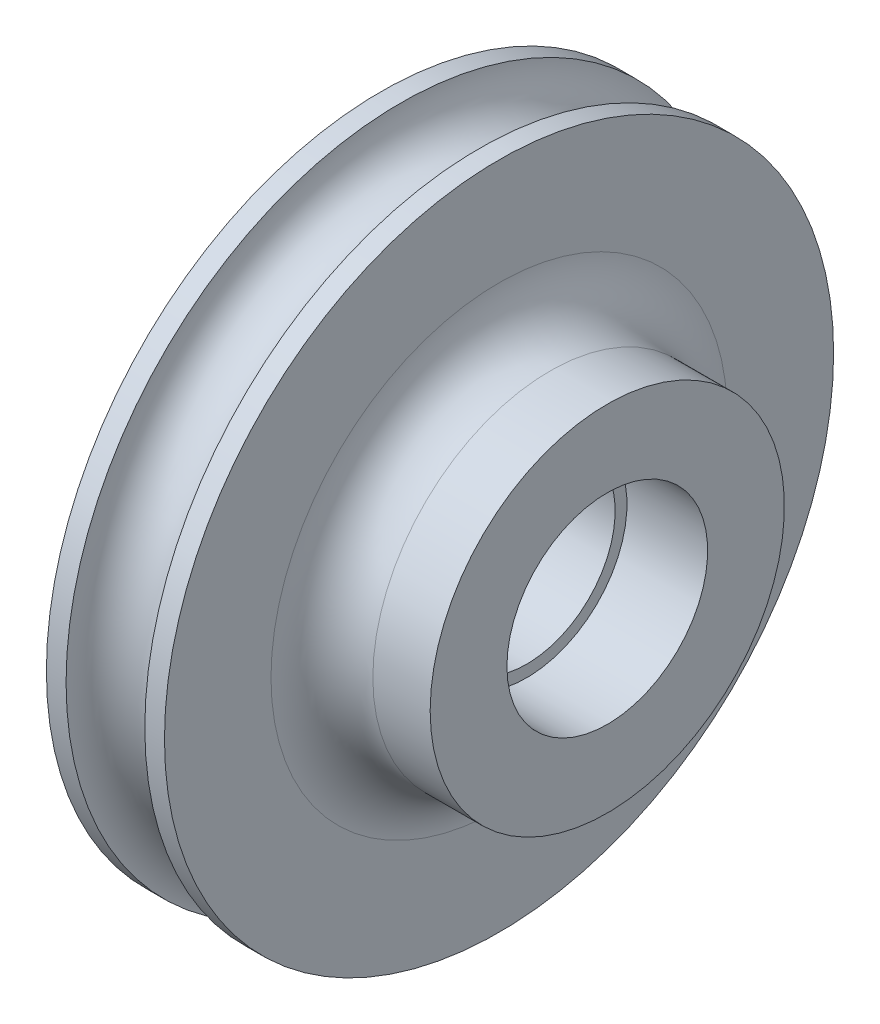
ISO-10303-21;
HEADER;
FILE_DESCRIPTION(('STEP AP214'),'2;1');
FILE_NAME('part.step','',(''),(''),'','','');
FILE_SCHEMA(('AUTOMOTIVE_DESIGN { 1 0 10303 214 1 1 1 1 }'));
ENDSEC;
DATA;
#1=APPLICATION_CONTEXT('core data for automotive mechanical design processes');
#2=APPLICATION_PROTOCOL_DEFINITION('international standard','automotive_design',2000,#1);
#3=PRODUCT_CONTEXT('',#1,'mechanical');
#4=PRODUCT('Part','Part','',(#3));
#5=PRODUCT_RELATED_PRODUCT_CATEGORY('part','',(#4));
#6=PRODUCT_DEFINITION_FORMATION('','',#4);
#7=PRODUCT_DEFINITION_CONTEXT('part definition',#1,'design');
#8=PRODUCT_DEFINITION('design','',#6,#7);
#9=PRODUCT_DEFINITION_SHAPE('','',#8);
#10=(LENGTH_UNIT() NAMED_UNIT(*) SI_UNIT(.MILLI.,.METRE.));
#11=(NAMED_UNIT(*) PLANE_ANGLE_UNIT() SI_UNIT($,.RADIAN.));
#12=(NAMED_UNIT(*) SI_UNIT($,.STERADIAN.) SOLID_ANGLE_UNIT());
#13=UNCERTAINTY_MEASURE_WITH_UNIT(LENGTH_MEASURE(1.E-05),#10,'distance_accuracy_value','');
#14=(GEOMETRIC_REPRESENTATION_CONTEXT(3) GLOBAL_UNCERTAINTY_ASSIGNED_CONTEXT((#13)) GLOBAL_UNIT_ASSIGNED_CONTEXT((#10,
#11,#12)) REPRESENTATION_CONTEXT('',''));
#15=CARTESIAN_POINT('',(0.,0.,0.));
#16=DIRECTION('',(0.,0.,1.));
#17=DIRECTION('',(1.,0.,0.));
#18=AXIS2_PLACEMENT_3D('',#15,#16,#17);
#19=CARTESIAN_POINT('',(0.,0.,0.));
#20=DIRECTION('',(-1.,0.,0.));
#21=DIRECTION('',(0.,0.,1.));
#22=AXIS2_PLACEMENT_3D('',#19,#20,#21);
#23=TOROIDAL_SURFACE('',#22,17.,2.);
#24=CARTESIAN_POINT('',(-2.,0.,0.));
#25=DIRECTION('',(-1.,0.,0.));
#26=DIRECTION('',(0.,0.,1.));
#27=AXIS2_PLACEMENT_3D('',#24,#25,#26);
#28=CIRCLE('',#27,17.);
#29=CARTESIAN_POINT('',(-2.,0.,17.));
#30=VERTEX_POINT('',#29);
#31=EDGE_CURVE('E10',#30,#30,#28,.T.);
#32=ORIENTED_EDGE('',*,*,#31,.F.);
#33=EDGE_LOOP('',(#32));
#34=FACE_BOUND('',#33,.T.);
#35=CARTESIAN_POINT('',(2.,0.,0.));
#36=DIRECTION('',(-1.,0.,0.));
#37=DIRECTION('',(0.,0.,1.));
#38=AXIS2_PLACEMENT_3D('',#35,#36,#37);
#39=CIRCLE('',#38,17.);
#40=CARTESIAN_POINT('',(2.,0.,17.));
#41=VERTEX_POINT('',#40);
#42=EDGE_CURVE('E76',#41,#41,#39,.T.);
#43=ORIENTED_EDGE('',*,*,#42,.T.);
#44=EDGE_LOOP('',(#43));
#45=FACE_BOUND('',#44,.T.);
#46=ADVANCED_FACE('F33',(#34,#45),#23,.F.);
#47=CARTESIAN_POINT('',(0.,0.,0.));
#48=DIRECTION('',(-1.,0.,0.));
#49=DIRECTION('',(0.,0.,1.));
#50=AXIS2_PLACEMENT_3D('',#47,#48,#49);
#51=CYLINDRICAL_SURFACE('',#50,17.);
#52=CARTESIAN_POINT('',(-3.,0.,0.));
#53=DIRECTION('',(-1.,0.,0.));
#54=DIRECTION('',(0.,0.,1.));
#55=AXIS2_PLACEMENT_3D('',#52,#53,#54);
#56=CIRCLE('',#55,17.);
#57=CARTESIAN_POINT('',(-3.,0.,17.));
#58=VERTEX_POINT('',#57);
#59=EDGE_CURVE('E39',#58,#58,#56,.T.);
#60=ORIENTED_EDGE('',*,*,#59,.F.);
#61=EDGE_LOOP('',(#60));
#62=FACE_BOUND('',#61,.T.);
#63=ORIENTED_EDGE('',*,*,#31,.T.);
#64=EDGE_LOOP('',(#63));
#65=FACE_BOUND('',#64,.T.);
#66=ADVANCED_FACE('F143',(#62,#65),#51,.T.);
#67=CARTESIAN_POINT('',(-3.,17.,0.));
#68=DIRECTION('',(1.,0.,0.));
#69=DIRECTION('',(0.,0.,-1.));
#70=AXIS2_PLACEMENT_3D('',#67,#68,#69);
#71=PLANE('',#70);
#72=CARTESIAN_POINT('',(-3.,0.,0.));
#73=DIRECTION('',(-1.,0.,0.));
#74=DIRECTION('',(0.,0.,1.));
#75=AXIS2_PLACEMENT_3D('',#72,#73,#74);
#76=CIRCLE('',#75,5.1);
#77=CARTESIAN_POINT('',(-3.,0.,5.1));
#78=VERTEX_POINT('',#77);
#79=EDGE_CURVE('E43',#78,#78,#76,.T.);
#80=ORIENTED_EDGE('',*,*,#79,.F.);
#81=EDGE_LOOP('',(#80));
#82=FACE_BOUND('',#81,.T.);
#83=ORIENTED_EDGE('',*,*,#59,.T.);
#84=EDGE_LOOP('',(#83));
#85=FACE_BOUND('',#84,.T.);
#86=ADVANCED_FACE('F138',(#82,#85),#71,.F.);
#87=CARTESIAN_POINT('',(0.,0.,0.));
#88=DIRECTION('',(-1.,0.,0.));
#89=DIRECTION('',(0.,0.,1.));
#90=AXIS2_PLACEMENT_3D('',#87,#88,#89);
#91=CYLINDRICAL_SURFACE('',#90,5.1);
#92=CARTESIAN_POINT('',(1.1,0.,0.));
#93=DIRECTION('',(-1.,0.,0.));
#94=DIRECTION('',(0.,0.,1.));
#95=AXIS2_PLACEMENT_3D('',#92,#93,#94);
#96=CIRCLE('',#95,5.1);
#97=CARTESIAN_POINT('',(1.1,0.,5.1));
#98=VERTEX_POINT('',#97);
#99=EDGE_CURVE('E47',#98,#98,#96,.T.);
#100=ORIENTED_EDGE('',*,*,#99,.F.);
#101=EDGE_LOOP('',(#100));
#102=FACE_BOUND('',#101,.T.);
#103=ORIENTED_EDGE('',*,*,#79,.T.);
#104=EDGE_LOOP('',(#103));
#105=FACE_BOUND('',#104,.T.);
#106=ADVANCED_FACE('F132',(#102,#105),#91,.F.);
#107=CARTESIAN_POINT('',(1.1,5.1,0.));
#108=DIRECTION('',(1.,0.,0.));
#109=DIRECTION('',(0.,0.,-1.));
#110=AXIS2_PLACEMENT_3D('',#107,#108,#109);
#111=PLANE('',#110);
#112=CARTESIAN_POINT('',(1.1,0.,0.));
#113=DIRECTION('',(-1.,0.,0.));
#114=DIRECTION('',(0.,0.,1.));
#115=AXIS2_PLACEMENT_3D('',#112,#113,#114);
#116=CIRCLE('',#115,4.5);
#117=CARTESIAN_POINT('',(1.1,0.,4.5));
#118=VERTEX_POINT('',#117);
#119=EDGE_CURVE('E52',#118,#118,#116,.T.);
#120=ORIENTED_EDGE('',*,*,#119,.F.);
#121=EDGE_LOOP('',(#120));
#122=FACE_BOUND('',#121,.T.);
#123=ORIENTED_EDGE('',*,*,#99,.T.);
#124=EDGE_LOOP('',(#123));
#125=FACE_BOUND('',#124,.T.);
#126=ADVANCED_FACE('F126',(#122,#125),#111,.F.);
#127=CARTESIAN_POINT('',(0.,0.,0.));
#128=DIRECTION('',(-1.,0.,0.));
#129=DIRECTION('',(0.,0.,1.));
#130=AXIS2_PLACEMENT_3D('',#127,#128,#129);
#131=CYLINDRICAL_SURFACE('',#130,4.5);
#132=CARTESIAN_POINT('',(4.4,0.,0.));
#133=DIRECTION('',(-1.,0.,0.));
#134=DIRECTION('',(0.,0.,1.));
#135=AXIS2_PLACEMENT_3D('',#132,#133,#134);
#136=CIRCLE('',#135,4.5);
#137=CARTESIAN_POINT('',(4.4,0.,4.5));
#138=VERTEX_POINT('',#137);
#139=EDGE_CURVE('E55',#138,#138,#136,.T.);
#140=ORIENTED_EDGE('',*,*,#139,.F.);
#141=EDGE_LOOP('',(#140));
#142=FACE_BOUND('',#141,.T.);
#143=ORIENTED_EDGE('',*,*,#119,.T.);
#144=EDGE_LOOP('',(#143));
#145=FACE_BOUND('',#144,.T.);
#146=ADVANCED_FACE('F120',(#142,#145),#131,.F.);
#147=CARTESIAN_POINT('',(4.4,5.1,0.));
#148=DIRECTION('',(-1.,0.,0.));
#149=DIRECTION('',(0.,0.,1.));
#150=AXIS2_PLACEMENT_3D('',#147,#148,#149);
#151=PLANE('',#150);
#152=CARTESIAN_POINT('',(4.4,0.,0.));
#153=DIRECTION('',(-1.,0.,0.));
#154=DIRECTION('',(0.,0.,1.));
#155=AXIS2_PLACEMENT_3D('',#152,#153,#154);
#156=CIRCLE('',#155,5.1);
#157=CARTESIAN_POINT('',(4.4,0.,5.1));
#158=VERTEX_POINT('',#157);
#159=EDGE_CURVE('E58',#158,#158,#156,.T.);
#160=ORIENTED_EDGE('',*,*,#159,.F.);
#161=EDGE_LOOP('',(#160));
#162=FACE_BOUND('',#161,.T.);
#163=ORIENTED_EDGE('',*,*,#139,.T.);
#164=EDGE_LOOP('',(#163));
#165=FACE_BOUND('',#164,.T.);
#166=ADVANCED_FACE('F114',(#162,#165),#151,.F.);
#167=CARTESIAN_POINT('',(0.,0.,0.));
#168=DIRECTION('',(-1.,0.,0.));
#169=DIRECTION('',(0.,0.,1.));
#170=AXIS2_PLACEMENT_3D('',#167,#168,#169);
#171=CYLINDRICAL_SURFACE('',#170,5.1);
#172=CARTESIAN_POINT('',(8.5,0.,0.));
#173=DIRECTION('',(-1.,0.,0.));
#174=DIRECTION('',(0.,0.,1.));
#175=AXIS2_PLACEMENT_3D('',#172,#173,#174);
#176=CIRCLE('',#175,5.1);
#177=CARTESIAN_POINT('',(8.5,0.,5.1));
#178=VERTEX_POINT('',#177);
#179=EDGE_CURVE('E61',#178,#178,#176,.T.);
#180=ORIENTED_EDGE('',*,*,#179,.F.);
#181=EDGE_LOOP('',(#180));
#182=FACE_BOUND('',#181,.T.);
#183=ORIENTED_EDGE('',*,*,#159,.T.);
#184=EDGE_LOOP('',(#183));
#185=FACE_BOUND('',#184,.T.);
#186=ADVANCED_FACE('F108',(#182,#185),#171,.F.);
#187=CARTESIAN_POINT('',(8.5,9.,0.));
#188=DIRECTION('',(-1.,0.,0.));
#189=DIRECTION('',(0.,0.,1.));
#190=AXIS2_PLACEMENT_3D('',#187,#188,#189);
#191=PLANE('',#190);
#192=CARTESIAN_POINT('',(8.5,0.,0.));
#193=DIRECTION('',(-1.,0.,0.));
#194=DIRECTION('',(0.,0.,1.));
#195=AXIS2_PLACEMENT_3D('',#192,#193,#194);
#196=CIRCLE('',#195,9.);
#197=CARTESIAN_POINT('',(8.5,0.,9.));
#198=VERTEX_POINT('',#197);
#199=EDGE_CURVE('E64',#198,#198,#196,.T.);
#200=ORIENTED_EDGE('',*,*,#199,.F.);
#201=EDGE_LOOP('',(#200));
#202=FACE_BOUND('',#201,.T.);
#203=ORIENTED_EDGE('',*,*,#179,.T.);
#204=EDGE_LOOP('',(#203));
#205=FACE_BOUND('',#204,.T.);
#206=ADVANCED_FACE('F102',(#202,#205),#191,.F.);
#207=CARTESIAN_POINT('',(0.,0.,0.));
#208=DIRECTION('',(-1.,0.,0.));
#209=DIRECTION('',(0.,0.,1.));
#210=AXIS2_PLACEMENT_3D('',#207,#208,#209);
#211=CYLINDRICAL_SURFACE('',#210,9.);
#212=CARTESIAN_POINT('',(5.58796448278056,0.,0.));
#213=DIRECTION('',(-1.,0.,0.));
#214=DIRECTION('',(0.,0.,1.));
#215=AXIS2_PLACEMENT_3D('',#212,#213,#214);
#216=CIRCLE('',#215,9.);
#217=CARTESIAN_POINT('',(5.58796448278056,0.,9.));
#218=VERTEX_POINT('',#217);
#219=EDGE_CURVE('E67',#218,#218,#216,.T.);
#220=ORIENTED_EDGE('',*,*,#219,.F.);
#221=EDGE_LOOP('',(#220));
#222=FACE_BOUND('',#221,.T.);
#223=ORIENTED_EDGE('',*,*,#199,.T.);
#224=EDGE_LOOP('',(#223));
#225=FACE_BOUND('',#224,.T.);
#226=ADVANCED_FACE('F96',(#222,#225),#211,.T.);
#227=CARTESIAN_POINT('',(5.58796448278056,0.,0.));
#228=DIRECTION('',(-1.,0.,0.));
#229=DIRECTION('',(0.,0.,1.));
#230=AXIS2_PLACEMENT_3D('',#227,#228,#229);
#231=TOROIDAL_SURFACE('',#230,11.5879644827806,2.58796448278056);
#232=CARTESIAN_POINT('',(3.,0.,0.));
#233=DIRECTION('',(-1.,0.,0.));
#234=DIRECTION('',(0.,0.,1.));
#235=AXIS2_PLACEMENT_3D('',#232,#233,#234);
#236=CIRCLE('',#235,11.5879644827806);
#237=CARTESIAN_POINT('',(3.,0.,11.5879644827806));
#238=VERTEX_POINT('',#237);
#239=EDGE_CURVE('E70',#238,#238,#236,.T.);
#240=ORIENTED_EDGE('',*,*,#239,.F.);
#241=EDGE_LOOP('',(#240));
#242=FACE_BOUND('',#241,.T.);
#243=ORIENTED_EDGE('',*,*,#219,.T.);
#244=EDGE_LOOP('',(#243));
#245=FACE_BOUND('',#244,.T.);
#246=ADVANCED_FACE('F90',(#242,#245),#231,.F.);
#247=CARTESIAN_POINT('',(3.,17.,0.));
#248=DIRECTION('',(-1.,0.,0.));
#249=DIRECTION('',(0.,0.,1.));
#250=AXIS2_PLACEMENT_3D('',#247,#248,#249);
#251=PLANE('',#250);
#252=CARTESIAN_POINT('',(3.,0.,0.));
#253=DIRECTION('',(-1.,0.,0.));
#254=DIRECTION('',(0.,0.,1.));
#255=AXIS2_PLACEMENT_3D('',#252,#253,#254);
#256=CIRCLE('',#255,17.);
#257=CARTESIAN_POINT('',(3.,0.,17.));
#258=VERTEX_POINT('',#257);
#259=EDGE_CURVE('E73',#258,#258,#256,.T.);
#260=ORIENTED_EDGE('',*,*,#259,.F.);
#261=EDGE_LOOP('',(#260));
#262=FACE_BOUND('',#261,.T.);
#263=ORIENTED_EDGE('',*,*,#239,.T.);
#264=EDGE_LOOP('',(#263));
#265=FACE_BOUND('',#264,.T.);
#266=ADVANCED_FACE('F84',(#262,#265),#251,.F.);
#267=CARTESIAN_POINT('',(0.,0.,0.));
#268=DIRECTION('',(-1.,0.,0.));
#269=DIRECTION('',(0.,0.,1.));
#270=AXIS2_PLACEMENT_3D('',#267,#268,#269);
#271=CYLINDRICAL_SURFACE('',#270,17.);
#272=ORIENTED_EDGE('',*,*,#42,.F.);
#273=EDGE_LOOP('',(#272));
#274=FACE_BOUND('',#273,.T.);
#275=ORIENTED_EDGE('',*,*,#259,.T.);
#276=EDGE_LOOP('',(#275));
#277=FACE_BOUND('',#276,.T.);
#278=ADVANCED_FACE('F81',(#274,#277),#271,.T.);
#279=CLOSED_SHELL('',(#46,#66,#86,#106,#126,#146,#166,#186,#206,#226,#246,#266,#278));
#280=MANIFOLD_SOLID_BREP('B2',#279);
#281=ADVANCED_BREP_SHAPE_REPRESENTATION('',(#18,#280),#14);
#282=SHAPE_DEFINITION_REPRESENTATION(#9,#281);
ENDSEC;
END-ISO-10303-21;
